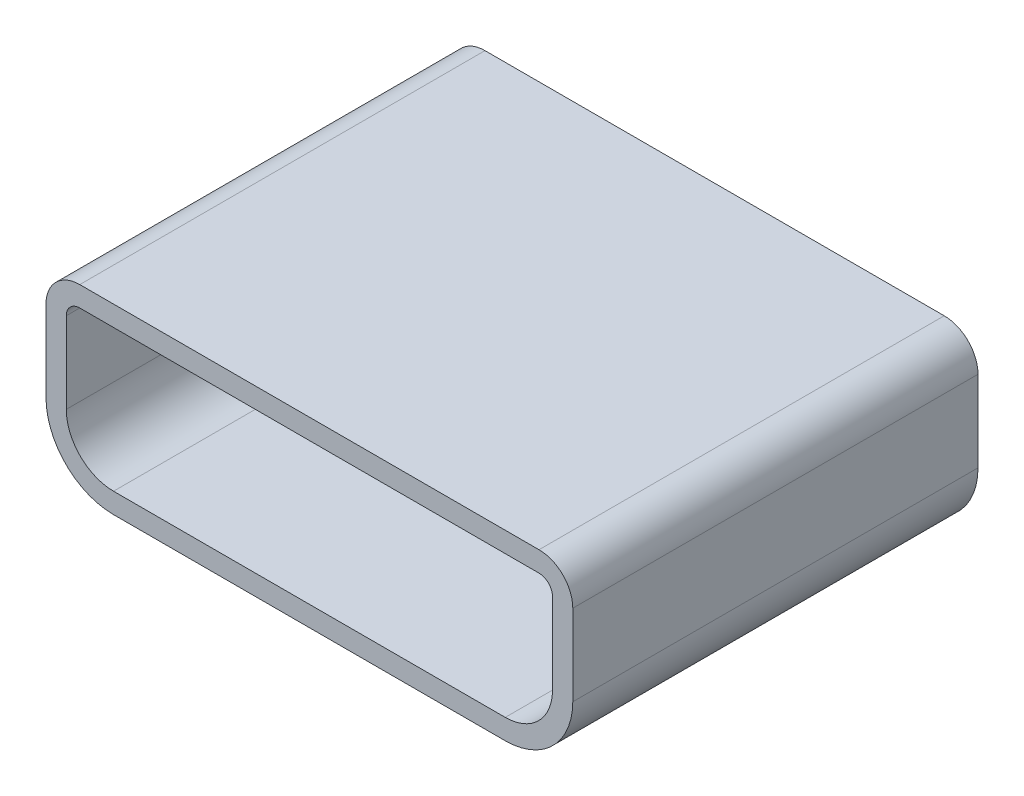
ISO-10303-21;
HEADER;
FILE_DESCRIPTION(('STEP AP214'),'2;1');
FILE_NAME('part.step','',(''),(''),'','','');
FILE_SCHEMA(('AUTOMOTIVE_DESIGN { 1 0 10303 214 1 1 1 1 }'));
ENDSEC;
DATA;
#1=APPLICATION_CONTEXT('core data for automotive mechanical design processes');
#2=APPLICATION_PROTOCOL_DEFINITION('international standard','automotive_design',2000,#1);
#3=PRODUCT_CONTEXT('',#1,'mechanical');
#4=PRODUCT('Part','Part','',(#3));
#5=PRODUCT_RELATED_PRODUCT_CATEGORY('part','',(#4));
#6=PRODUCT_DEFINITION_FORMATION('','',#4);
#7=PRODUCT_DEFINITION_CONTEXT('part definition',#1,'design');
#8=PRODUCT_DEFINITION('design','',#6,#7);
#9=PRODUCT_DEFINITION_SHAPE('','',#8);
#10=(LENGTH_UNIT() NAMED_UNIT(*) SI_UNIT(.MILLI.,.METRE.));
#11=(NAMED_UNIT(*) PLANE_ANGLE_UNIT() SI_UNIT($,.RADIAN.));
#12=(NAMED_UNIT(*) SI_UNIT($,.STERADIAN.) SOLID_ANGLE_UNIT());
#13=UNCERTAINTY_MEASURE_WITH_UNIT(LENGTH_MEASURE(1.E-05),#10,'distance_accuracy_value','');
#14=(GEOMETRIC_REPRESENTATION_CONTEXT(3) GLOBAL_UNCERTAINTY_ASSIGNED_CONTEXT((#13)) GLOBAL_UNIT_ASSIGNED_CONTEXT((#10,
#11,#12)) REPRESENTATION_CONTEXT('',''));
#15=CARTESIAN_POINT('',(0.,0.,0.));
#16=DIRECTION('',(0.,0.,1.));
#17=DIRECTION('',(1.,0.,0.));
#18=AXIS2_PLACEMENT_3D('',#15,#16,#17);
#19=CARTESIAN_POINT('',(-3.7,4.79,18.69));
#20=DIRECTION('',(-1.,0.,0.));
#21=DIRECTION('',(0.,0.,1.));
#22=AXIS2_PLACEMENT_3D('',#19,#20,#21);
#23=PLANE('',#22);
#24=DIRECTION('',(0.,0.,-1.));
#25=VECTOR('',#24,1.);
#26=CARTESIAN_POINT('',(-3.70000000000001,4.8,21.7));
#27=LINE('',#26,#25);
#28=CARTESIAN_POINT('',(-3.70000000000001,4.8,24.7));
#29=VERTEX_POINT('',#28);
#30=CARTESIAN_POINT('',(-3.7,4.8,18.7));
#31=VERTEX_POINT('',#30);
#32=EDGE_CURVE('E195',#29,#31,#27,.T.);
#33=ORIENTED_EDGE('',*,*,#32,.F.);
#34=DIRECTION('',(0.,1.,0.));
#35=VECTOR('',#34,1.);
#36=CARTESIAN_POINT('',(-3.70000000000001,5.4,24.7));
#37=LINE('',#36,#35);
#38=CARTESIAN_POINT('',(-3.70000000000001,6.,24.7));
#39=VERTEX_POINT('',#38);
#40=EDGE_CURVE('E189',#29,#39,#37,.T.);
#41=ORIENTED_EDGE('',*,*,#40,.T.);
#42=DIRECTION('',(0.,0.,1.));
#43=VECTOR('',#42,1.);
#44=CARTESIAN_POINT('',(-3.7,6.,21.7));
#45=LINE('',#44,#43);
#46=CARTESIAN_POINT('',(-3.7,6.,18.7));
#47=VERTEX_POINT('',#46);
#48=EDGE_CURVE('E190',#47,#39,#45,.T.);
#49=ORIENTED_EDGE('',*,*,#48,.F.);
#50=DIRECTION('',(0.,-1.,0.));
#51=VECTOR('',#50,1.);
#52=CARTESIAN_POINT('',(-3.7,5.4,18.7));
#53=LINE('',#52,#51);
#54=EDGE_CURVE('E199',#47,#31,#53,.T.);
#55=ORIENTED_EDGE('',*,*,#54,.T.);
#56=EDGE_LOOP('',(#33,#41,#49,#55));
#57=FACE_BOUND('',#56,.T.);
#58=ADVANCED_FACE('F16',(#57),#23,.T.);
#59=CARTESIAN_POINT('',(4.1,4.79,24.71));
#60=DIRECTION('',(1.,0.,0.));
#61=DIRECTION('',(0.,0.,-1.));
#62=AXIS2_PLACEMENT_3D('',#59,#60,#61);
#63=PLANE('',#62);
#64=DIRECTION('',(0.,0.,1.));
#65=VECTOR('',#64,1.);
#66=CARTESIAN_POINT('',(4.1,4.8,21.7));
#67=LINE('',#66,#65);
#68=CARTESIAN_POINT('',(4.1,4.8,18.7));
#69=VERTEX_POINT('',#68);
#70=CARTESIAN_POINT('',(4.1,4.8,24.7));
#71=VERTEX_POINT('',#70);
#72=EDGE_CURVE('E184',#69,#71,#67,.T.);
#73=ORIENTED_EDGE('',*,*,#72,.F.);
#74=DIRECTION('',(0.,-1.,0.));
#75=VECTOR('',#74,1.);
#76=CARTESIAN_POINT('',(4.1,5.15,18.7));
#77=LINE('',#76,#75);
#78=CARTESIAN_POINT('',(4.1,6.,18.7));
#79=VERTEX_POINT('',#78);
#80=EDGE_CURVE('E180',#79,#69,#77,.T.);
#81=ORIENTED_EDGE('',*,*,#80,.F.);
#82=DIRECTION('',(0.,0.,-1.));
#83=VECTOR('',#82,1.);
#84=CARTESIAN_POINT('',(4.1,6.,21.7));
#85=LINE('',#84,#83);
#86=CARTESIAN_POINT('',(4.1,6.,24.7));
#87=VERTEX_POINT('',#86);
#88=EDGE_CURVE('E120',#87,#79,#85,.T.);
#89=ORIENTED_EDGE('',*,*,#88,.F.);
#90=DIRECTION('',(0.,-1.,0.));
#91=VECTOR('',#90,1.);
#92=CARTESIAN_POINT('',(4.1,5.4,24.7));
#93=LINE('',#92,#91);
#94=EDGE_CURVE('E117',#87,#71,#93,.T.);
#95=ORIENTED_EDGE('',*,*,#94,.T.);
#96=EDGE_LOOP('',(#73,#81,#89,#95));
#97=FACE_BOUND('',#96,.T.);
#98=ADVANCED_FACE('F253',(#97),#63,.T.);
#99=CARTESIAN_POINT('',(3.6,6.,18.7));
#100=DIRECTION('',(0.,0.,1.));
#101=DIRECTION('',(1.,0.,0.));
#102=AXIS2_PLACEMENT_3D('',#99,#100,#101);
#103=CYLINDRICAL_SURFACE('',#102,0.5);
#104=CARTESIAN_POINT('',(3.6,6.,24.7));
#105=DIRECTION('',(0.,0.,1.));
#106=DIRECTION('',(1.,0.,0.));
#107=AXIS2_PLACEMENT_3D('',#104,#105,#106);
#108=CIRCLE('',#107,0.5);
#109=CARTESIAN_POINT('',(3.6,6.5,24.7));
#110=VERTEX_POINT('',#109);
#111=EDGE_CURVE('E20',#110,#87,#108,.F.);
#112=ORIENTED_EDGE('',*,*,#111,.T.);
#113=ORIENTED_EDGE('',*,*,#88,.T.);
#114=CARTESIAN_POINT('',(3.6,6.,18.7));
#115=DIRECTION('',(0.,0.,1.));
#116=DIRECTION('',(1.,0.,0.));
#117=AXIS2_PLACEMENT_3D('',#114,#115,#116);
#118=CIRCLE('',#117,0.5);
#119=CARTESIAN_POINT('',(3.6,6.5,18.7));
#120=VERTEX_POINT('',#119);
#121=EDGE_CURVE('E125',#120,#79,#118,.F.);
#122=ORIENTED_EDGE('',*,*,#121,.F.);
#123=DIRECTION('',(0.,0.,-1.));
#124=VECTOR('',#123,1.);
#125=CARTESIAN_POINT('',(3.6,6.5,21.7));
#126=LINE('',#125,#124);
#127=EDGE_CURVE('E122',#110,#120,#126,.T.);
#128=ORIENTED_EDGE('',*,*,#127,.F.);
#129=EDGE_LOOP('',(#112,#113,#122,#128));
#130=FACE_BOUND('',#129,.T.);
#131=ADVANCED_FACE('F123',(#130),#103,.T.);
#132=CARTESIAN_POINT('',(-3.2,6.,24.7));
#133=DIRECTION('',(0.,0.,-1.));
#134=DIRECTION('',(-1.,0.,0.));
#135=AXIS2_PLACEMENT_3D('',#132,#133,#134);
#136=CYLINDRICAL_SURFACE('',#135,0.5);
#137=CARTESIAN_POINT('',(-3.2,6.,18.7));
#138=DIRECTION('',(0.,0.,-1.));
#139=DIRECTION('',(-1.,0.,0.));
#140=AXIS2_PLACEMENT_3D('',#137,#138,#139);
#141=CIRCLE('',#140,0.5);
#142=CARTESIAN_POINT('',(-3.2,6.5,18.7));
#143=VERTEX_POINT('',#142);
#144=EDGE_CURVE('E228',#47,#143,#141,.T.);
#145=ORIENTED_EDGE('',*,*,#144,.F.);
#146=ORIENTED_EDGE('',*,*,#48,.T.);
#147=CARTESIAN_POINT('',(-3.2,6.,24.7));
#148=DIRECTION('',(0.,0.,-1.));
#149=DIRECTION('',(-1.,0.,0.));
#150=AXIS2_PLACEMENT_3D('',#147,#148,#149);
#151=CIRCLE('',#150,0.5);
#152=CARTESIAN_POINT('',(-3.2,6.5,24.7));
#153=VERTEX_POINT('',#152);
#154=EDGE_CURVE('E194',#39,#153,#151,.T.);
#155=ORIENTED_EDGE('',*,*,#154,.T.);
#156=DIRECTION('',(0.,0.,1.));
#157=VECTOR('',#156,1.);
#158=CARTESIAN_POINT('',(-3.2,6.5,21.7));
#159=LINE('',#158,#157);
#160=EDGE_CURVE('E135',#143,#153,#159,.T.);
#161=ORIENTED_EDGE('',*,*,#160,.F.);
#162=EDGE_LOOP('',(#145,#146,#155,#161));
#163=FACE_BOUND('',#162,.T.);
#164=ADVANCED_FACE('F236',(#163),#136,.T.);
#165=CARTESIAN_POINT('',(-2.7,4.8,24.7));
#166=DIRECTION('',(0.,0.,-1.));
#167=DIRECTION('',(-1.,0.,0.));
#168=AXIS2_PLACEMENT_3D('',#165,#166,#167);
#169=CYLINDRICAL_SURFACE('',#168,1.);
#170=CARTESIAN_POINT('',(-2.7,4.8,18.7));
#171=DIRECTION('',(0.,0.,-1.));
#172=DIRECTION('',(-1.,0.,0.));
#173=AXIS2_PLACEMENT_3D('',#170,#171,#172);
#174=CIRCLE('',#173,1.);
#175=CARTESIAN_POINT('',(-2.7,3.8,18.7));
#176=VERTEX_POINT('',#175);
#177=EDGE_CURVE('E182',#176,#31,#174,.T.);
#178=ORIENTED_EDGE('',*,*,#177,.F.);
#179=DIRECTION('',(0.,0.,-1.));
#180=VECTOR('',#179,1.);
#181=CARTESIAN_POINT('',(-2.7,3.8,21.7));
#182=LINE('',#181,#180);
#183=CARTESIAN_POINT('',(-2.7,3.8,24.7));
#184=VERTEX_POINT('',#183);
#185=EDGE_CURVE('E171',#184,#176,#182,.T.);
#186=ORIENTED_EDGE('',*,*,#185,.F.);
#187=CARTESIAN_POINT('',(-2.7,4.8,24.7));
#188=DIRECTION('',(0.,0.,-1.));
#189=DIRECTION('',(-1.,0.,0.));
#190=AXIS2_PLACEMENT_3D('',#187,#188,#189);
#191=CIRCLE('',#190,1.);
#192=EDGE_CURVE('E193',#184,#29,#191,.T.);
#193=ORIENTED_EDGE('',*,*,#192,.T.);
#194=ORIENTED_EDGE('',*,*,#32,.T.);
#195=EDGE_LOOP('',(#178,#186,#193,#194));
#196=FACE_BOUND('',#195,.T.);
#197=ADVANCED_FACE('F242',(#196),#169,.T.);
#198=CARTESIAN_POINT('',(4.11,3.79,18.7));
#199=DIRECTION('',(0.,0.,-1.));
#200=DIRECTION('',(-1.,0.,0.));
#201=AXIS2_PLACEMENT_3D('',#198,#199,#200);
#202=PLANE('',#201);
#203=ORIENTED_EDGE('',*,*,#144,.T.);
#204=DIRECTION('',(-1.,0.,0.));
#205=VECTOR('',#204,1.);
#206=CARTESIAN_POINT('',(0.199999999999995,6.5,18.7));
#207=LINE('',#206,#205);
#208=EDGE_CURVE('E129',#120,#143,#207,.T.);
#209=ORIENTED_EDGE('',*,*,#208,.F.);
#210=ORIENTED_EDGE('',*,*,#121,.T.);
#211=ORIENTED_EDGE('',*,*,#80,.T.);
#212=CARTESIAN_POINT('',(3.1,4.8,18.7));
#213=DIRECTION('',(0.,0.,1.));
#214=DIRECTION('',(1.,0.,0.));
#215=AXIS2_PLACEMENT_3D('',#212,#213,#214);
#216=CIRCLE('',#215,0.999999999999999);
#217=CARTESIAN_POINT('',(3.1,3.8,18.7));
#218=VERTEX_POINT('',#217);
#219=EDGE_CURVE('E187',#218,#69,#216,.T.);
#220=ORIENTED_EDGE('',*,*,#219,.F.);
#221=DIRECTION('',(1.,0.,0.));
#222=VECTOR('',#221,1.);
#223=CARTESIAN_POINT('',(0.2,3.8,18.7));
#224=LINE('',#223,#222);
#225=EDGE_CURVE('E174',#176,#218,#224,.T.);
#226=ORIENTED_EDGE('',*,*,#225,.F.);
#227=ORIENTED_EDGE('',*,*,#177,.T.);
#228=ORIENTED_EDGE('',*,*,#54,.F.);
#229=EDGE_LOOP('',(#203,#209,#210,#211,#220,#226,#227,#228));
#230=FACE_BOUND('',#229,.T.);
#231=ADVANCED_FACE('F255',(#230),#202,.T.);
#232=CARTESIAN_POINT('',(3.1,4.8,18.7));
#233=DIRECTION('',(0.,0.,1.));
#234=DIRECTION('',(1.,0.,0.));
#235=AXIS2_PLACEMENT_3D('',#232,#233,#234);
#236=CYLINDRICAL_SURFACE('',#235,0.999999999999999);
#237=CARTESIAN_POINT('',(3.1,4.8,24.7));
#238=DIRECTION('',(0.,0.,1.));
#239=DIRECTION('',(1.,0.,0.));
#240=AXIS2_PLACEMENT_3D('',#237,#238,#239);
#241=CIRCLE('',#240,0.999999999999999);
#242=CARTESIAN_POINT('',(3.1,3.8,24.7));
#243=VERTEX_POINT('',#242);
#244=EDGE_CURVE('E130',#71,#243,#241,.F.);
#245=ORIENTED_EDGE('',*,*,#244,.T.);
#246=DIRECTION('',(0.,0.,1.));
#247=VECTOR('',#246,1.);
#248=CARTESIAN_POINT('',(3.1,3.8,21.7));
#249=LINE('',#248,#247);
#250=EDGE_CURVE('E143',#218,#243,#249,.T.);
#251=ORIENTED_EDGE('',*,*,#250,.F.);
#252=ORIENTED_EDGE('',*,*,#219,.T.);
#253=ORIENTED_EDGE('',*,*,#72,.T.);
#254=EDGE_LOOP('',(#245,#251,#252,#253));
#255=FACE_BOUND('',#254,.T.);
#256=ADVANCED_FACE('F249',(#255),#236,.T.);
#257=CARTESIAN_POINT('',(-3.21000000000001,6.5,18.69));
#258=DIRECTION('',(0.,1.,0.));
#259=DIRECTION('',(0.,0.,1.));
#260=AXIS2_PLACEMENT_3D('',#257,#258,#259);
#261=PLANE('',#260);
#262=ORIENTED_EDGE('',*,*,#160,.T.);
#263=DIRECTION('',(-1.,0.,0.));
#264=VECTOR('',#263,1.);
#265=CARTESIAN_POINT('',(0.199999999999995,6.5,24.7));
#266=LINE('',#265,#264);
#267=EDGE_CURVE('E116',#110,#153,#266,.T.);
#268=ORIENTED_EDGE('',*,*,#267,.F.);
#269=ORIENTED_EDGE('',*,*,#127,.T.);
#270=ORIENTED_EDGE('',*,*,#208,.T.);
#271=EDGE_LOOP('',(#262,#268,#269,#270));
#272=FACE_BOUND('',#271,.T.);
#273=ADVANCED_FACE('F133',(#272),#261,.T.);
#274=CARTESIAN_POINT('',(-2.71,3.8,18.69));
#275=DIRECTION('',(0.,-1.,0.));
#276=DIRECTION('',(1.,0.,0.));
#277=AXIS2_PLACEMENT_3D('',#274,#275,#276);
#278=PLANE('',#277);
#279=ORIENTED_EDGE('',*,*,#250,.T.);
#280=DIRECTION('',(1.,0.,0.));
#281=VECTOR('',#280,1.);
#282=CARTESIAN_POINT('',(0.199999999999994,3.8,24.7));
#283=LINE('',#282,#281);
#284=EDGE_CURVE('E136',#184,#243,#283,.T.);
#285=ORIENTED_EDGE('',*,*,#284,.F.);
#286=ORIENTED_EDGE('',*,*,#185,.T.);
#287=ORIENTED_EDGE('',*,*,#225,.T.);
#288=EDGE_LOOP('',(#279,#285,#286,#287));
#289=FACE_BOUND('',#288,.T.);
#290=ADVANCED_FACE('F245',(#289),#278,.T.);
#291=CARTESIAN_POINT('',(3.79987961871081,4.79,24.71));
#292=DIRECTION('',(-1.,0.,0.));
#293=DIRECTION('',(0.,1.,0.));
#294=AXIS2_PLACEMENT_3D('',#291,#292,#293);
#295=PLANE('',#294);
#296=DIRECTION('',(0.,1.,0.));
#297=VECTOR('',#296,1.);
#298=CARTESIAN_POINT('',(3.79987961871081,5.15,19.7));
#299=LINE('',#298,#297);
#300=CARTESIAN_POINT('',(3.79987961871081,4.8,19.7));
#301=VERTEX_POINT('',#300);
#302=CARTESIAN_POINT('',(3.79987961871081,6.00000000000001,19.7));
#303=VERTEX_POINT('',#302);
#304=EDGE_CURVE('E208',#301,#303,#299,.T.);
#305=ORIENTED_EDGE('',*,*,#304,.F.);
#306=DIRECTION('',(0.,0.,-1.));
#307=VECTOR('',#306,1.);
#308=CARTESIAN_POINT('',(3.79987961871081,4.8,22.2));
#309=LINE('',#308,#307);
#310=CARTESIAN_POINT('',(3.79987961871081,4.8,24.7));
#311=VERTEX_POINT('',#310);
#312=EDGE_CURVE('E137',#311,#301,#309,.T.);
#313=ORIENTED_EDGE('',*,*,#312,.F.);
#314=DIRECTION('',(0.,-1.,0.));
#315=VECTOR('',#314,1.);
#316=CARTESIAN_POINT('',(3.79987961871081,5.15,24.7));
#317=LINE('',#316,#315);
#318=CARTESIAN_POINT('',(3.79987961871081,6.00000000000001,24.7));
#319=VERTEX_POINT('',#318);
#320=EDGE_CURVE('E222',#319,#311,#317,.T.);
#321=ORIENTED_EDGE('',*,*,#320,.F.);
#322=DIRECTION('',(0.,0.,1.));
#323=VECTOR('',#322,1.);
#324=CARTESIAN_POINT('',(3.79987961871081,6.,22.2));
#325=LINE('',#324,#323);
#326=EDGE_CURVE('E165',#303,#319,#325,.T.);
#327=ORIENTED_EDGE('',*,*,#326,.F.);
#328=EDGE_LOOP('',(#305,#313,#321,#327));
#329=FACE_BOUND('',#328,.T.);
#330=ADVANCED_FACE('F322',(#329),#295,.T.);
#331=CARTESIAN_POINT('',(3.1,4.8,24.7));
#332=DIRECTION('',(0.,0.,-1.));
#333=DIRECTION('',(-1.,0.,0.));
#334=AXIS2_PLACEMENT_3D('',#331,#332,#333);
#335=CYLINDRICAL_SURFACE('',#334,0.699879618710814);
#336=CARTESIAN_POINT('',(3.1,4.8,19.7));
#337=DIRECTION('',(0.,0.,-1.));
#338=DIRECTION('',(-1.,0.,0.));
#339=AXIS2_PLACEMENT_3D('',#336,#337,#338);
#340=CIRCLE('',#339,0.699879618710814);
#341=CARTESIAN_POINT('',(3.1,4.10012038128918,19.7));
#342=VERTEX_POINT('',#341);
#343=EDGE_CURVE('E209',#342,#301,#340,.F.);
#344=ORIENTED_EDGE('',*,*,#343,.F.);
#345=DIRECTION('',(0.,0.,-1.));
#346=VECTOR('',#345,1.);
#347=CARTESIAN_POINT('',(3.1,4.10012038128918,22.2));
#348=LINE('',#347,#346);
#349=CARTESIAN_POINT('',(3.1,4.10012038128918,24.7));
#350=VERTEX_POINT('',#349);
#351=EDGE_CURVE('E152',#350,#342,#348,.T.);
#352=ORIENTED_EDGE('',*,*,#351,.F.);
#353=CARTESIAN_POINT('',(3.1,4.8,24.7));
#354=DIRECTION('',(0.,0.,-1.));
#355=DIRECTION('',(-1.,0.,0.));
#356=AXIS2_PLACEMENT_3D('',#353,#354,#355);
#357=CIRCLE('',#356,0.699879618710814);
#358=EDGE_CURVE('E220',#311,#350,#357,.T.);
#359=ORIENTED_EDGE('',*,*,#358,.F.);
#360=ORIENTED_EDGE('',*,*,#312,.T.);
#361=EDGE_LOOP('',(#344,#352,#359,#360));
#362=FACE_BOUND('',#361,.T.);
#363=ADVANCED_FACE('F308',(#362),#335,.F.);
#364=CARTESIAN_POINT('',(-3.71,3.79,24.7));
#365=DIRECTION('',(0.,0.,1.));
#366=DIRECTION('',(1.,0.,0.));
#367=AXIS2_PLACEMENT_3D('',#364,#365,#366);
#368=PLANE('',#367);
#369=DIRECTION('',(1.,0.,0.));
#370=VECTOR('',#369,1.);
#371=CARTESIAN_POINT('',(0.2,4.10012038128918,24.7));
#372=LINE('',#371,#370);
#373=CARTESIAN_POINT('',(-2.7,4.10012038128918,24.7));
#374=VERTEX_POINT('',#373);
#375=EDGE_CURVE('E155',#374,#350,#372,.T.);
#376=ORIENTED_EDGE('',*,*,#375,.F.);
#377=CARTESIAN_POINT('',(-2.7,4.8,24.7));
#378=DIRECTION('',(0.,0.,-1.));
#379=DIRECTION('',(-1.,0.,0.));
#380=AXIS2_PLACEMENT_3D('',#377,#378,#379);
#381=CIRCLE('',#380,0.699879618710819);
#382=CARTESIAN_POINT('',(-3.39987961871082,4.8,24.7));
#383=VERTEX_POINT('',#382);
#384=EDGE_CURVE('E217',#374,#383,#381,.T.);
#385=ORIENTED_EDGE('',*,*,#384,.T.);
#386=DIRECTION('',(0.,1.,0.));
#387=VECTOR('',#386,1.);
#388=CARTESIAN_POINT('',(-3.39987961871082,5.15,24.7));
#389=LINE('',#388,#387);
#390=CARTESIAN_POINT('',(-3.39987961871082,6.,24.7));
#391=VERTEX_POINT('',#390);
#392=EDGE_CURVE('E140',#383,#391,#389,.T.);
#393=ORIENTED_EDGE('',*,*,#392,.T.);
#394=CARTESIAN_POINT('',(-3.2,6.,24.7));
#395=DIRECTION('',(0.,0.,-1.));
#396=DIRECTION('',(-1.,0.,0.));
#397=AXIS2_PLACEMENT_3D('',#394,#395,#396);
#398=CIRCLE('',#397,0.19987961871082);
#399=CARTESIAN_POINT('',(-3.20000000000001,6.19987961871082,24.7));
#400=VERTEX_POINT('',#399);
#401=EDGE_CURVE('E223',#391,#400,#398,.T.);
#402=ORIENTED_EDGE('',*,*,#401,.T.);
#403=DIRECTION('',(-1.,0.,0.));
#404=VECTOR('',#403,1.);
#405=CARTESIAN_POINT('',(0.199999999999995,6.19987961871082,24.7));
#406=LINE('',#405,#404);
#407=CARTESIAN_POINT('',(3.6,6.19987961871082,24.7));
#408=VERTEX_POINT('',#407);
#409=EDGE_CURVE('E147',#408,#400,#406,.T.);
#410=ORIENTED_EDGE('',*,*,#409,.F.);
#411=CARTESIAN_POINT('',(3.6,6.00000000000001,24.7));
#412=DIRECTION('',(0.,0.,-1.));
#413=DIRECTION('',(-1.,0.,0.));
#414=AXIS2_PLACEMENT_3D('',#411,#412,#413);
#415=CIRCLE('',#414,0.19987961871081);
#416=EDGE_CURVE('E205',#319,#408,#415,.F.);
#417=ORIENTED_EDGE('',*,*,#416,.F.);
#418=ORIENTED_EDGE('',*,*,#320,.T.);
#419=ORIENTED_EDGE('',*,*,#358,.T.);
#420=EDGE_LOOP('',(#376,#385,#393,#402,#410,#417,#418,#419));
#421=FACE_BOUND('',#420,.T.);
#422=ORIENTED_EDGE('',*,*,#244,.F.);
#423=ORIENTED_EDGE('',*,*,#94,.F.);
#424=ORIENTED_EDGE('',*,*,#111,.F.);
#425=ORIENTED_EDGE('',*,*,#267,.T.);
#426=ORIENTED_EDGE('',*,*,#154,.F.);
#427=ORIENTED_EDGE('',*,*,#40,.F.);
#428=ORIENTED_EDGE('',*,*,#192,.F.);
#429=ORIENTED_EDGE('',*,*,#284,.T.);
#430=EDGE_LOOP('',(#422,#423,#424,#425,#426,#427,#428,#429));
#431=FACE_BOUND('',#430,.T.);
#432=ADVANCED_FACE('F114',(#421,#431),#368,.T.);
#433=CARTESIAN_POINT('',(-3.40987961871082,4.09012038128918,19.7));
#434=DIRECTION('',(0.,0.,1.));
#435=DIRECTION('',(1.,0.,0.));
#436=AXIS2_PLACEMENT_3D('',#433,#434,#435);
#437=PLANE('',#436);
#438=CARTESIAN_POINT('',(3.6,6.00000000000001,19.7));
#439=DIRECTION('',(0.,0.,-1.));
#440=DIRECTION('',(-1.,0.,0.));
#441=AXIS2_PLACEMENT_3D('',#438,#439,#440);
#442=CIRCLE('',#441,0.19987961871081);
#443=CARTESIAN_POINT('',(3.6,6.19987961871082,19.7));
#444=VERTEX_POINT('',#443);
#445=EDGE_CURVE('E167',#444,#303,#442,.T.);
#446=ORIENTED_EDGE('',*,*,#445,.F.);
#447=DIRECTION('',(1.,0.,0.));
#448=VECTOR('',#447,1.);
#449=CARTESIAN_POINT('',(0.199999999999995,6.19987961871082,19.7));
#450=LINE('',#449,#448);
#451=CARTESIAN_POINT('',(-3.20000000000001,6.19987961871082,19.7));
#452=VERTEX_POINT('',#451);
#453=EDGE_CURVE('E150',#452,#444,#450,.T.);
#454=ORIENTED_EDGE('',*,*,#453,.F.);
#455=CARTESIAN_POINT('',(-3.2,6.,19.7));
#456=DIRECTION('',(0.,0.,-1.));
#457=DIRECTION('',(-1.,0.,0.));
#458=AXIS2_PLACEMENT_3D('',#455,#456,#457);
#459=CIRCLE('',#458,0.19987961871082);
#460=CARTESIAN_POINT('',(-3.39987961871082,6.,19.7));
#461=VERTEX_POINT('',#460);
#462=EDGE_CURVE('E35',#452,#461,#459,.F.);
#463=ORIENTED_EDGE('',*,*,#462,.T.);
#464=DIRECTION('',(0.,-1.,0.));
#465=VECTOR('',#464,1.);
#466=CARTESIAN_POINT('',(-3.39987961871082,5.15,19.7));
#467=LINE('',#466,#465);
#468=CARTESIAN_POINT('',(-3.39987961871082,4.80000000000001,19.7));
#469=VERTEX_POINT('',#468);
#470=EDGE_CURVE('E215',#461,#469,#467,.T.);
#471=ORIENTED_EDGE('',*,*,#470,.T.);
#472=CARTESIAN_POINT('',(-2.69999999999998,4.80000000000002,19.7));
#473=DIRECTION('',(0.,0.,-1.));
#474=DIRECTION('',(-1.,0.,0.));
#475=AXIS2_PLACEMENT_3D('',#472,#473,#474);
#476=CIRCLE('',#475,0.699879618710819);
#477=CARTESIAN_POINT('',(-2.69999999999999,4.10012038128918,19.7));
#478=VERTEX_POINT('',#477);
#479=EDGE_CURVE('E212',#469,#478,#476,.F.);
#480=ORIENTED_EDGE('',*,*,#479,.T.);
#481=DIRECTION('',(-1.,0.,0.));
#482=VECTOR('',#481,1.);
#483=CARTESIAN_POINT('',(0.2,4.10012038128918,19.7));
#484=LINE('',#483,#482);
#485=EDGE_CURVE('E151',#342,#478,#484,.T.);
#486=ORIENTED_EDGE('',*,*,#485,.F.);
#487=ORIENTED_EDGE('',*,*,#343,.T.);
#488=ORIENTED_EDGE('',*,*,#304,.T.);
#489=EDGE_LOOP('',(#446,#454,#463,#471,#480,#486,#487,#488));
#490=FACE_BOUND('',#489,.T.);
#491=ADVANCED_FACE('F278',(#490),#437,.T.);
#492=CARTESIAN_POINT('',(3.6,6.00000000000001,24.7));
#493=DIRECTION('',(0.,0.,-1.));
#494=DIRECTION('',(-1.,0.,0.));
#495=AXIS2_PLACEMENT_3D('',#492,#493,#494);
#496=CYLINDRICAL_SURFACE('',#495,0.19987961871081);
#497=ORIENTED_EDGE('',*,*,#445,.T.);
#498=ORIENTED_EDGE('',*,*,#326,.T.);
#499=ORIENTED_EDGE('',*,*,#416,.T.);
#500=DIRECTION('',(0.,0.,1.));
#501=VECTOR('',#500,1.);
#502=CARTESIAN_POINT('',(3.6,6.19987961871082,22.2));
#503=LINE('',#502,#501);
#504=EDGE_CURVE('E162',#444,#408,#503,.T.);
#505=ORIENTED_EDGE('',*,*,#504,.F.);
#506=EDGE_LOOP('',(#497,#498,#499,#505));
#507=FACE_BOUND('',#506,.T.);
#508=ADVANCED_FACE('F320',(#507),#496,.F.);
#509=CARTESIAN_POINT('',(-2.71,4.10012038128918,24.71));
#510=DIRECTION('',(0.,1.,0.));
#511=DIRECTION('',(1.,0.,0.));
#512=AXIS2_PLACEMENT_3D('',#509,#510,#511);
#513=PLANE('',#512);
#514=ORIENTED_EDGE('',*,*,#485,.T.);
#515=DIRECTION('',(0.,0.,-1.));
#516=VECTOR('',#515,1.);
#517=CARTESIAN_POINT('',(-2.7,4.10012038128918,22.2));
#518=LINE('',#517,#516);
#519=EDGE_CURVE('E158',#374,#478,#518,.T.);
#520=ORIENTED_EDGE('',*,*,#519,.F.);
#521=ORIENTED_EDGE('',*,*,#375,.T.);
#522=ORIENTED_EDGE('',*,*,#351,.T.);
#523=EDGE_LOOP('',(#514,#520,#521,#522));
#524=FACE_BOUND('',#523,.T.);
#525=ADVANCED_FACE('F301',(#524),#513,.T.);
#526=CARTESIAN_POINT('',(3.61,6.19987961871082,24.71));
#527=DIRECTION('',(0.,-1.,0.));
#528=DIRECTION('',(-1.,0.,0.));
#529=AXIS2_PLACEMENT_3D('',#526,#527,#528);
#530=PLANE('',#529);
#531=ORIENTED_EDGE('',*,*,#453,.T.);
#532=ORIENTED_EDGE('',*,*,#504,.T.);
#533=ORIENTED_EDGE('',*,*,#409,.T.);
#534=DIRECTION('',(0.,0.,1.));
#535=VECTOR('',#534,1.);
#536=CARTESIAN_POINT('',(-3.20000000000001,6.19987961871082,22.2));
#537=LINE('',#536,#535);
#538=EDGE_CURVE('E161',#452,#400,#537,.T.);
#539=ORIENTED_EDGE('',*,*,#538,.F.);
#540=EDGE_LOOP('',(#531,#532,#533,#539));
#541=FACE_BOUND('',#540,.T.);
#542=ADVANCED_FACE('F286',(#541),#530,.T.);
#543=CARTESIAN_POINT('',(-2.7,4.8,24.7));
#544=DIRECTION('',(0.,0.,-1.));
#545=DIRECTION('',(-1.,0.,0.));
#546=AXIS2_PLACEMENT_3D('',#543,#544,#545);
#547=CYLINDRICAL_SURFACE('',#546,0.699879618710819);
#548=ORIENTED_EDGE('',*,*,#479,.F.);
#549=DIRECTION('',(0.,0.,-1.));
#550=VECTOR('',#549,1.);
#551=CARTESIAN_POINT('',(-3.39987961871082,4.8,22.2));
#552=LINE('',#551,#550);
#553=EDGE_CURVE('E26',#383,#469,#552,.T.);
#554=ORIENTED_EDGE('',*,*,#553,.F.);
#555=ORIENTED_EDGE('',*,*,#384,.F.);
#556=ORIENTED_EDGE('',*,*,#519,.T.);
#557=EDGE_LOOP('',(#548,#554,#555,#556));
#558=FACE_BOUND('',#557,.T.);
#559=ADVANCED_FACE('F271',(#558),#547,.F.);
#560=CARTESIAN_POINT('',(-3.2,6.,24.7));
#561=DIRECTION('',(0.,0.,-1.));
#562=DIRECTION('',(-1.,0.,0.));
#563=AXIS2_PLACEMENT_3D('',#560,#561,#562);
#564=CYLINDRICAL_SURFACE('',#563,0.19987961871082);
#565=ORIENTED_EDGE('',*,*,#462,.F.);
#566=ORIENTED_EDGE('',*,*,#538,.T.);
#567=ORIENTED_EDGE('',*,*,#401,.F.);
#568=DIRECTION('',(0.,0.,1.));
#569=VECTOR('',#568,1.);
#570=CARTESIAN_POINT('',(-3.39987961871082,6.,22.2));
#571=LINE('',#570,#569);
#572=EDGE_CURVE('E11',#461,#391,#571,.T.);
#573=ORIENTED_EDGE('',*,*,#572,.F.);
#574=EDGE_LOOP('',(#565,#566,#567,#573));
#575=FACE_BOUND('',#574,.T.);
#576=ADVANCED_FACE('F266',(#575),#564,.F.);
#577=CARTESIAN_POINT('',(-3.39987961871082,6.01,24.71));
#578=DIRECTION('',(1.,0.,0.));
#579=DIRECTION('',(0.,-1.,0.));
#580=AXIS2_PLACEMENT_3D('',#577,#578,#579);
#581=PLANE('',#580);
#582=ORIENTED_EDGE('',*,*,#470,.F.);
#583=ORIENTED_EDGE('',*,*,#572,.T.);
#584=ORIENTED_EDGE('',*,*,#392,.F.);
#585=ORIENTED_EDGE('',*,*,#553,.T.);
#586=EDGE_LOOP('',(#582,#583,#584,#585));
#587=FACE_BOUND('',#586,.T.);
#588=ADVANCED_FACE('F18',(#587),#581,.T.);
#589=CLOSED_SHELL('',(#58,#98,#131,#164,#197,#231,#256,#273,#290,#330,#363,#432,#491,#508,#525,
#542,#559,#576,#588));
#590=MANIFOLD_SOLID_BREP('B1',#589);
#591=ADVANCED_BREP_SHAPE_REPRESENTATION('',(#18,#590),#14);
#592=SHAPE_DEFINITION_REPRESENTATION(#9,#591);
ENDSEC;
END-ISO-10303-21;
